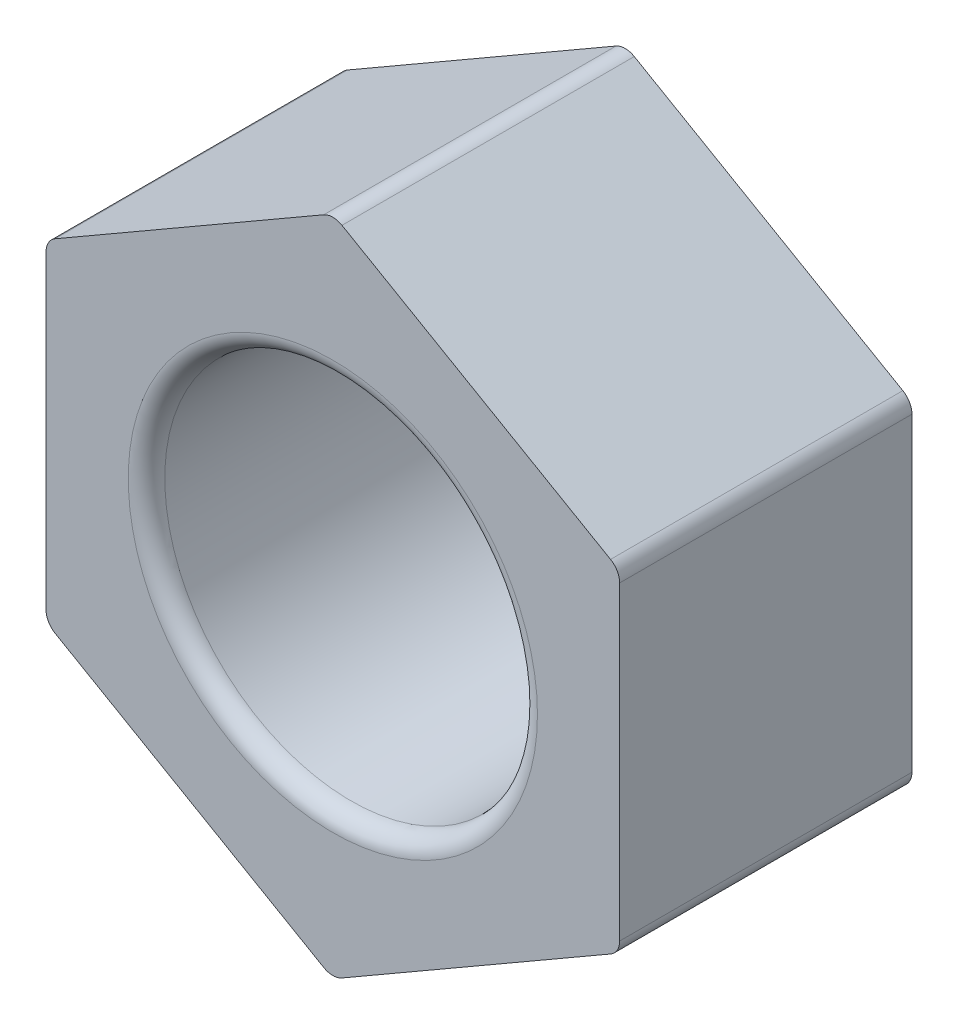
ISO-10303-21;
HEADER;
FILE_DESCRIPTION(('STEP AP214'),'2;1');
FILE_NAME('part.step','',(''),(''),'','','');
FILE_SCHEMA(('AUTOMOTIVE_DESIGN { 1 0 10303 214 1 1 1 1 }'));
ENDSEC;
DATA;
#1=APPLICATION_CONTEXT('core data for automotive mechanical design processes');
#2=APPLICATION_PROTOCOL_DEFINITION('international standard','automotive_design',2000,#1);
#3=PRODUCT_CONTEXT('',#1,'mechanical');
#4=PRODUCT('Part','Part','',(#3));
#5=PRODUCT_RELATED_PRODUCT_CATEGORY('part','',(#4));
#6=PRODUCT_DEFINITION_FORMATION('','',#4);
#7=PRODUCT_DEFINITION_CONTEXT('part definition',#1,'design');
#8=PRODUCT_DEFINITION('design','',#6,#7);
#9=PRODUCT_DEFINITION_SHAPE('','',#8);
#10=(LENGTH_UNIT() NAMED_UNIT(*) SI_UNIT(.MILLI.,.METRE.));
#11=(NAMED_UNIT(*) PLANE_ANGLE_UNIT() SI_UNIT($,.RADIAN.));
#12=(NAMED_UNIT(*) SI_UNIT($,.STERADIAN.) SOLID_ANGLE_UNIT());
#13=UNCERTAINTY_MEASURE_WITH_UNIT(LENGTH_MEASURE(1.E-05),#10,'distance_accuracy_value','');
#14=(GEOMETRIC_REPRESENTATION_CONTEXT(3) GLOBAL_UNCERTAINTY_ASSIGNED_CONTEXT((#13)) GLOBAL_UNIT_ASSIGNED_CONTEXT((#10,
#11,#12)) REPRESENTATION_CONTEXT('',''));
#15=CARTESIAN_POINT('',(0.,0.,0.));
#16=DIRECTION('',(0.,0.,1.));
#17=DIRECTION('',(1.,0.,0.));
#18=AXIS2_PLACEMENT_3D('',#15,#16,#17);
#19=CARTESIAN_POINT('',(3.925,2.26609980656928,4.));
#20=DIRECTION('',(-0.5,-0.866025403784439,0.));
#21=DIRECTION('',(0.866025403784439,-0.5,0.));
#22=AXIS2_PLACEMENT_3D('',#19,#20,#21);
#23=PLANE('',#22);
#24=DIRECTION('',(-0.866025403784439,0.5,0.));
#25=VECTOR('',#24,1.);
#26=CARTESIAN_POINT('',(3.925,2.26609980656928,4.));
#27=LINE('',#26,#25);
#28=CARTESIAN_POINT('',(3.8,2.33826859021799,4.));
#29=VERTEX_POINT('',#28);
#30=CARTESIAN_POINT('',(0.124999999999998,4.46003082948986,4.));
#31=VERTEX_POINT('',#30);
#32=EDGE_CURVE('E135',#29,#31,#27,.T.);
#33=ORIENTED_EDGE('',*,*,#32,.F.);
#34=DIRECTION('',(0.,0.,-1.));
#35=VECTOR('',#34,1.);
#36=CARTESIAN_POINT('',(3.8,2.33826859021799,4.));
#37=LINE('',#36,#35);
#38=CARTESIAN_POINT('',(3.8,2.33826859021799,0.));
#39=VERTEX_POINT('',#38);
#40=EDGE_CURVE('E11',#29,#39,#37,.T.);
#41=ORIENTED_EDGE('',*,*,#40,.T.);
#42=DIRECTION('',(-0.866025403784439,0.5,0.));
#43=VECTOR('',#42,1.);
#44=CARTESIAN_POINT('',(3.925,2.26609980656928,0.));
#45=LINE('',#44,#43);
#46=CARTESIAN_POINT('',(0.124999999999998,4.46003082948986,0.));
#47=VERTEX_POINT('',#46);
#48=EDGE_CURVE('E295',#39,#47,#45,.T.);
#49=ORIENTED_EDGE('',*,*,#48,.T.);
#50=DIRECTION('',(0.,0.,-1.));
#51=VECTOR('',#50,1.);
#52=CARTESIAN_POINT('',(0.124999999999998,4.46003082948986,4.));
#53=LINE('',#52,#51);
#54=EDGE_CURVE('E47',#47,#31,#53,.F.);
#55=ORIENTED_EDGE('',*,*,#54,.T.);
#56=EDGE_LOOP('',(#33,#41,#49,#55));
#57=FACE_BOUND('',#56,.T.);
#58=ADVANCED_FACE('F39',(#57),#23,.F.);
#59=CARTESIAN_POINT('',(0.,4.53219961313857,4.));
#60=DIRECTION('',(0.5,-0.866025403784439,0.));
#61=DIRECTION('',(0.866025403784439,0.5,0.));
#62=AXIS2_PLACEMENT_3D('',#59,#60,#61);
#63=PLANE('',#62);
#64=DIRECTION('',(-0.866025403784439,-0.5,0.));
#65=VECTOR('',#64,1.);
#66=CARTESIAN_POINT('',(0.,4.53219961313857,0.));
#67=LINE('',#66,#65);
#68=CARTESIAN_POINT('',(-0.125000000000002,4.46003082948986,0.));
#69=VERTEX_POINT('',#68);
#70=CARTESIAN_POINT('',(-3.8,2.33826859021799,0.));
#71=VERTEX_POINT('',#70);
#72=EDGE_CURVE('E297',#69,#71,#67,.T.);
#73=ORIENTED_EDGE('',*,*,#72,.T.);
#74=DIRECTION('',(0.,0.,-1.));
#75=VECTOR('',#74,1.);
#76=CARTESIAN_POINT('',(-3.8,2.33826859021799,4.));
#77=LINE('',#76,#75);
#78=CARTESIAN_POINT('',(-3.8,2.33826859021799,4.));
#79=VERTEX_POINT('',#78);
#80=EDGE_CURVE('E178',#71,#79,#77,.F.);
#81=ORIENTED_EDGE('',*,*,#80,.T.);
#82=DIRECTION('',(-0.866025403784439,-0.5,0.));
#83=VECTOR('',#82,1.);
#84=CARTESIAN_POINT('',(0.,4.53219961313857,4.));
#85=LINE('',#84,#83);
#86=CARTESIAN_POINT('',(-0.125000000000002,4.46003082948986,4.));
#87=VERTEX_POINT('',#86);
#88=EDGE_CURVE('E148',#87,#79,#85,.T.);
#89=ORIENTED_EDGE('',*,*,#88,.F.);
#90=DIRECTION('',(0.,0.,-1.));
#91=VECTOR('',#90,1.);
#92=CARTESIAN_POINT('',(-0.125000000000002,4.46003082948986,4.));
#93=LINE('',#92,#91);
#94=EDGE_CURVE('E176',#87,#69,#93,.T.);
#95=ORIENTED_EDGE('',*,*,#94,.T.);
#96=EDGE_LOOP('',(#73,#81,#89,#95));
#97=FACE_BOUND('',#96,.T.);
#98=ADVANCED_FACE('F251',(#97),#63,.F.);
#99=CARTESIAN_POINT('',(-3.925,2.26609980656929,4.));
#100=DIRECTION('',(1.,0.,0.));
#101=DIRECTION('',(0.,1.,0.));
#102=AXIS2_PLACEMENT_3D('',#99,#100,#101);
#103=PLANE('',#102);
#104=DIRECTION('',(0.,-1.,0.));
#105=VECTOR('',#104,1.);
#106=CARTESIAN_POINT('',(-3.925,2.26609980656929,4.));
#107=LINE('',#106,#105);
#108=CARTESIAN_POINT('',(-3.925,2.12176223927188,4.));
#109=VERTEX_POINT('',#108);
#110=CARTESIAN_POINT('',(-3.925,-2.12176223927188,4.));
#111=VERTEX_POINT('',#110);
#112=EDGE_CURVE('E283',#109,#111,#107,.T.);
#113=ORIENTED_EDGE('',*,*,#112,.F.);
#114=DIRECTION('',(0.,0.,-1.));
#115=VECTOR('',#114,1.);
#116=CARTESIAN_POINT('',(-3.925,2.12176223927188,4.));
#117=LINE('',#116,#115);
#118=CARTESIAN_POINT('',(-3.925,2.12176223927188,0.));
#119=VERTEX_POINT('',#118);
#120=EDGE_CURVE('E173',#109,#119,#117,.T.);
#121=ORIENTED_EDGE('',*,*,#120,.T.);
#122=DIRECTION('',(0.,-1.,0.));
#123=VECTOR('',#122,1.);
#124=CARTESIAN_POINT('',(-3.925,2.26609980656929,0.));
#125=LINE('',#124,#123);
#126=CARTESIAN_POINT('',(-3.925,-2.12176223927188,0.));
#127=VERTEX_POINT('',#126);
#128=EDGE_CURVE('E299',#119,#127,#125,.T.);
#129=ORIENTED_EDGE('',*,*,#128,.T.);
#130=DIRECTION('',(0.,0.,-1.));
#131=VECTOR('',#130,1.);
#132=CARTESIAN_POINT('',(-3.925,-2.12176223927188,4.));
#133=LINE('',#132,#131);
#134=EDGE_CURVE('E171',#127,#111,#133,.F.);
#135=ORIENTED_EDGE('',*,*,#134,.T.);
#136=EDGE_LOOP('',(#113,#121,#129,#135));
#137=FACE_BOUND('',#136,.T.);
#138=ADVANCED_FACE('F256',(#137),#103,.F.);
#139=CARTESIAN_POINT('',(-3.925,-2.26609980656928,4.));
#140=DIRECTION('',(0.5,0.866025403784439,0.));
#141=DIRECTION('',(-0.866025403784439,0.5,0.));
#142=AXIS2_PLACEMENT_3D('',#139,#140,#141);
#143=PLANE('',#142);
#144=DIRECTION('',(0.866025403784439,-0.5,0.));
#145=VECTOR('',#144,1.);
#146=CARTESIAN_POINT('',(-3.925,-2.26609980656928,4.));
#147=LINE('',#146,#145);
#148=CARTESIAN_POINT('',(-3.8,-2.33826859021798,4.));
#149=VERTEX_POINT('',#148);
#150=CARTESIAN_POINT('',(-0.125000000000001,-4.46003082948986,4.));
#151=VERTEX_POINT('',#150);
#152=EDGE_CURVE('E286',#149,#151,#147,.T.);
#153=ORIENTED_EDGE('',*,*,#152,.F.);
#154=DIRECTION('',(0.,0.,-1.));
#155=VECTOR('',#154,1.);
#156=CARTESIAN_POINT('',(-3.8,-2.33826859021798,4.));
#157=LINE('',#156,#155);
#158=CARTESIAN_POINT('',(-3.8,-2.33826859021798,0.));
#159=VERTEX_POINT('',#158);
#160=EDGE_CURVE('E182',#149,#159,#157,.T.);
#161=ORIENTED_EDGE('',*,*,#160,.T.);
#162=DIRECTION('',(0.866025403784439,-0.5,0.));
#163=VECTOR('',#162,1.);
#164=CARTESIAN_POINT('',(-3.925,-2.26609980656928,0.));
#165=LINE('',#164,#163);
#166=CARTESIAN_POINT('',(-0.125000000000001,-4.46003082948986,0.));
#167=VERTEX_POINT('',#166);
#168=EDGE_CURVE('E203',#159,#167,#165,.T.);
#169=ORIENTED_EDGE('',*,*,#168,.T.);
#170=DIRECTION('',(0.,0.,-1.));
#171=VECTOR('',#170,1.);
#172=CARTESIAN_POINT('',(-0.125000000000001,-4.46003082948986,4.));
#173=LINE('',#172,#171);
#174=EDGE_CURVE('E180',#167,#151,#173,.F.);
#175=ORIENTED_EDGE('',*,*,#174,.T.);
#176=EDGE_LOOP('',(#153,#161,#169,#175));
#177=FACE_BOUND('',#176,.T.);
#178=ADVANCED_FACE('F306',(#177),#143,.F.);
#179=CARTESIAN_POINT('',(0.,-4.53219961313856,4.));
#180=DIRECTION('',(-0.5,0.866025403784439,0.));
#181=DIRECTION('',(-0.866025403784439,-0.5,0.));
#182=AXIS2_PLACEMENT_3D('',#179,#180,#181);
#183=PLANE('',#182);
#184=DIRECTION('',(0.866025403784439,0.5,0.));
#185=VECTOR('',#184,1.);
#186=CARTESIAN_POINT('',(0.,-4.53219961313856,4.));
#187=LINE('',#186,#185);
#188=CARTESIAN_POINT('',(0.124999999999999,-4.46003082948986,4.));
#189=VERTEX_POINT('',#188);
#190=CARTESIAN_POINT('',(3.8,-2.33826859021799,4.));
#191=VERTEX_POINT('',#190);
#192=EDGE_CURVE('E291',#189,#191,#187,.T.);
#193=ORIENTED_EDGE('',*,*,#192,.F.);
#194=DIRECTION('',(0.,0.,-1.));
#195=VECTOR('',#194,1.);
#196=CARTESIAN_POINT('',(0.124999999999999,-4.46003082948986,4.));
#197=LINE('',#196,#195);
#198=CARTESIAN_POINT('',(0.124999999999999,-4.46003082948986,0.));
#199=VERTEX_POINT('',#198);
#200=EDGE_CURVE('E187',#189,#199,#197,.T.);
#201=ORIENTED_EDGE('',*,*,#200,.T.);
#202=DIRECTION('',(0.866025403784439,0.5,0.));
#203=VECTOR('',#202,1.);
#204=CARTESIAN_POINT('',(0.,-4.53219961313856,0.));
#205=LINE('',#204,#203);
#206=CARTESIAN_POINT('',(3.8,-2.33826859021799,0.));
#207=VERTEX_POINT('',#206);
#208=EDGE_CURVE('E201',#199,#207,#205,.T.);
#209=ORIENTED_EDGE('',*,*,#208,.T.);
#210=DIRECTION('',(0.,0.,-1.));
#211=VECTOR('',#210,1.);
#212=CARTESIAN_POINT('',(3.8,-2.33826859021799,4.));
#213=LINE('',#212,#211);
#214=EDGE_CURVE('E185',#207,#191,#213,.F.);
#215=ORIENTED_EDGE('',*,*,#214,.T.);
#216=EDGE_LOOP('',(#193,#201,#209,#215));
#217=FACE_BOUND('',#216,.T.);
#218=ADVANCED_FACE('F312',(#217),#183,.F.);
#219=CARTESIAN_POINT('',(3.925,-2.26609980656928,4.));
#220=DIRECTION('',(-1.,0.,0.));
#221=DIRECTION('',(0.,0.,1.));
#222=AXIS2_PLACEMENT_3D('',#219,#220,#221);
#223=PLANE('',#222);
#224=DIRECTION('',(0.,1.,0.));
#225=VECTOR('',#224,1.);
#226=CARTESIAN_POINT('',(3.925,-2.26609980656928,4.));
#227=LINE('',#226,#225);
#228=CARTESIAN_POINT('',(3.925,-2.12176223927188,4.));
#229=VERTEX_POINT('',#228);
#230=CARTESIAN_POINT('',(3.925,2.12176223927188,4.));
#231=VERTEX_POINT('',#230);
#232=EDGE_CURVE('E138',#229,#231,#227,.T.);
#233=ORIENTED_EDGE('',*,*,#232,.F.);
#234=DIRECTION('',(0.,0.,-1.));
#235=VECTOR('',#234,1.);
#236=CARTESIAN_POINT('',(3.925,-2.12176223927188,4.));
#237=LINE('',#236,#235);
#238=CARTESIAN_POINT('',(3.925,-2.12176223927188,0.));
#239=VERTEX_POINT('',#238);
#240=EDGE_CURVE('E191',#229,#239,#237,.T.);
#241=ORIENTED_EDGE('',*,*,#240,.T.);
#242=DIRECTION('',(0.,1.,0.));
#243=VECTOR('',#242,1.);
#244=CARTESIAN_POINT('',(3.925,-2.26609980656928,0.));
#245=LINE('',#244,#243);
#246=CARTESIAN_POINT('',(3.925,2.12176223927188,0.));
#247=VERTEX_POINT('',#246);
#248=EDGE_CURVE('E149',#239,#247,#245,.T.);
#249=ORIENTED_EDGE('',*,*,#248,.T.);
#250=DIRECTION('',(0.,0.,-1.));
#251=VECTOR('',#250,1.);
#252=CARTESIAN_POINT('',(3.925,2.12176223927188,4.));
#253=LINE('',#252,#251);
#254=EDGE_CURVE('E153',#247,#231,#253,.F.);
#255=ORIENTED_EDGE('',*,*,#254,.T.);
#256=EDGE_LOOP('',(#233,#241,#249,#255));
#257=FACE_BOUND('',#256,.T.);
#258=ADVANCED_FACE('F195',(#257),#223,.F.);
#259=CARTESIAN_POINT('',(0.,0.,4.));
#260=DIRECTION('',(0.,0.,1.));
#261=DIRECTION('',(1.,0.,0.));
#262=AXIS2_PLACEMENT_3D('',#259,#260,#261);
#263=PLANE('',#262);
#264=CARTESIAN_POINT('',(0.,0.,4.));
#265=DIRECTION('',(0.,0.,1.));
#266=DIRECTION('',(1.,0.,0.));
#267=AXIS2_PLACEMENT_3D('',#264,#265,#266);
#268=CIRCLE('',#267,2.8);
#269=CARTESIAN_POINT('',(2.8,0.,4.));
#270=VERTEX_POINT('',#269);
#271=EDGE_CURVE('E160',#270,#270,#268,.F.);
#272=ORIENTED_EDGE('',*,*,#271,.T.);
#273=EDGE_LOOP('',(#272));
#274=FACE_BOUND('',#273,.T.);
#275=ORIENTED_EDGE('',*,*,#88,.T.);
#276=CARTESIAN_POINT('',(-3.675,2.12176223927188,4.));
#277=DIRECTION('',(0.,0.,1.));
#278=DIRECTION('',(1.,0.,0.));
#279=AXIS2_PLACEMENT_3D('',#276,#277,#278);
#280=CIRCLE('',#279,0.25);
#281=EDGE_CURVE('E219',#79,#109,#280,.T.);
#282=ORIENTED_EDGE('',*,*,#281,.T.);
#283=ORIENTED_EDGE('',*,*,#112,.T.);
#284=CARTESIAN_POINT('',(-3.675,-2.12176223927187,4.));
#285=DIRECTION('',(0.,0.,1.));
#286=DIRECTION('',(1.,0.,0.));
#287=AXIS2_PLACEMENT_3D('',#284,#285,#286);
#288=CIRCLE('',#287,0.25);
#289=EDGE_CURVE('E217',#111,#149,#288,.T.);
#290=ORIENTED_EDGE('',*,*,#289,.T.);
#291=ORIENTED_EDGE('',*,*,#152,.T.);
#292=CARTESIAN_POINT('',(0.,-4.24352447854375,4.));
#293=DIRECTION('',(0.,0.,1.));
#294=DIRECTION('',(1.,0.,0.));
#295=AXIS2_PLACEMENT_3D('',#292,#293,#294);
#296=CIRCLE('',#295,0.25);
#297=EDGE_CURVE('E215',#151,#189,#296,.T.);
#298=ORIENTED_EDGE('',*,*,#297,.T.);
#299=ORIENTED_EDGE('',*,*,#192,.T.);
#300=CARTESIAN_POINT('',(3.675,-2.12176223927188,4.));
#301=DIRECTION('',(0.,0.,1.));
#302=DIRECTION('',(1.,0.,0.));
#303=AXIS2_PLACEMENT_3D('',#300,#301,#302);
#304=CIRCLE('',#303,0.25);
#305=EDGE_CURVE('E142',#191,#229,#304,.T.);
#306=ORIENTED_EDGE('',*,*,#305,.T.);
#307=ORIENTED_EDGE('',*,*,#232,.T.);
#308=CARTESIAN_POINT('',(3.675,2.12176223927188,4.));
#309=DIRECTION('',(0.,0.,1.));
#310=DIRECTION('',(1.,0.,0.));
#311=AXIS2_PLACEMENT_3D('',#308,#309,#310);
#312=CIRCLE('',#311,0.25);
#313=EDGE_CURVE('E131',#231,#29,#312,.T.);
#314=ORIENTED_EDGE('',*,*,#313,.T.);
#315=ORIENTED_EDGE('',*,*,#32,.T.);
#316=CARTESIAN_POINT('',(0.,4.24352447854375,4.));
#317=DIRECTION('',(0.,0.,1.));
#318=DIRECTION('',(1.,0.,0.));
#319=AXIS2_PLACEMENT_3D('',#316,#317,#318);
#320=CIRCLE('',#319,0.25);
#321=EDGE_CURVE('E143',#31,#87,#320,.T.);
#322=ORIENTED_EDGE('',*,*,#321,.T.);
#323=EDGE_LOOP('',(#275,#282,#283,#290,#291,#298,#299,#306,#307,#314,#315,#322));
#324=FACE_BOUND('',#323,.T.);
#325=ADVANCED_FACE('F134',(#274,#324),#263,.T.);
#326=CARTESIAN_POINT('',(0.,0.,0.));
#327=DIRECTION('',(0.,0.,1.));
#328=DIRECTION('',(1.,0.,0.));
#329=AXIS2_PLACEMENT_3D('',#326,#327,#328);
#330=PLANE('',#329);
#331=CARTESIAN_POINT('',(0.,0.,0.));
#332=DIRECTION('',(0.,0.,1.));
#333=DIRECTION('',(1.,0.,0.));
#334=AXIS2_PLACEMENT_3D('',#331,#332,#333);
#335=CIRCLE('',#334,2.8);
#336=CARTESIAN_POINT('',(2.8,0.,0.));
#337=VERTEX_POINT('',#336);
#338=EDGE_CURVE('E168',#337,#337,#335,.T.);
#339=ORIENTED_EDGE('',*,*,#338,.T.);
#340=EDGE_LOOP('',(#339));
#341=FACE_BOUND('',#340,.T.);
#342=ORIENTED_EDGE('',*,*,#128,.F.);
#343=CARTESIAN_POINT('',(-3.675,2.12176223927188,0.));
#344=DIRECTION('',(0.,0.,1.));
#345=DIRECTION('',(1.,0.,0.));
#346=AXIS2_PLACEMENT_3D('',#343,#344,#345);
#347=CIRCLE('',#346,0.25);
#348=EDGE_CURVE('E54',#119,#71,#347,.F.);
#349=ORIENTED_EDGE('',*,*,#348,.T.);
#350=ORIENTED_EDGE('',*,*,#72,.F.);
#351=CARTESIAN_POINT('',(0.,4.24352447854375,0.));
#352=DIRECTION('',(0.,0.,1.));
#353=DIRECTION('',(1.,0.,0.));
#354=AXIS2_PLACEMENT_3D('',#351,#352,#353);
#355=CIRCLE('',#354,0.25);
#356=EDGE_CURVE('E62',#69,#47,#355,.F.);
#357=ORIENTED_EDGE('',*,*,#356,.T.);
#358=ORIENTED_EDGE('',*,*,#48,.F.);
#359=CARTESIAN_POINT('',(3.675,2.12176223927188,0.));
#360=DIRECTION('',(0.,0.,1.));
#361=DIRECTION('',(1.,0.,0.));
#362=AXIS2_PLACEMENT_3D('',#359,#360,#361);
#363=CIRCLE('',#362,0.25);
#364=EDGE_CURVE('E152',#39,#247,#363,.F.);
#365=ORIENTED_EDGE('',*,*,#364,.T.);
#366=ORIENTED_EDGE('',*,*,#248,.F.);
#367=CARTESIAN_POINT('',(3.675,-2.12176223927188,0.));
#368=DIRECTION('',(0.,0.,1.));
#369=DIRECTION('',(1.,0.,0.));
#370=AXIS2_PLACEMENT_3D('',#367,#368,#369);
#371=CIRCLE('',#370,0.25);
#372=EDGE_CURVE('E156',#239,#207,#371,.F.);
#373=ORIENTED_EDGE('',*,*,#372,.T.);
#374=ORIENTED_EDGE('',*,*,#208,.F.);
#375=CARTESIAN_POINT('',(0.,-4.24352447854375,0.));
#376=DIRECTION('',(0.,0.,1.));
#377=DIRECTION('',(1.,0.,0.));
#378=AXIS2_PLACEMENT_3D('',#375,#376,#377);
#379=CIRCLE('',#378,0.25);
#380=EDGE_CURVE('E158',#199,#167,#379,.F.);
#381=ORIENTED_EDGE('',*,*,#380,.T.);
#382=ORIENTED_EDGE('',*,*,#168,.F.);
#383=CARTESIAN_POINT('',(-3.675,-2.12176223927187,0.));
#384=DIRECTION('',(0.,0.,1.));
#385=DIRECTION('',(1.,0.,0.));
#386=AXIS2_PLACEMENT_3D('',#383,#384,#385);
#387=CIRCLE('',#386,0.25);
#388=EDGE_CURVE('E165',#159,#127,#387,.F.);
#389=ORIENTED_EDGE('',*,*,#388,.T.);
#390=EDGE_LOOP('',(#342,#349,#350,#357,#358,#365,#366,#373,#374,#381,#382,#389));
#391=FACE_BOUND('',#390,.T.);
#392=ADVANCED_FACE('F198',(#341,#391),#330,.F.);
#393=CARTESIAN_POINT('',(0.,0.,0.));
#394=DIRECTION('',(0.,0.,1.));
#395=DIRECTION('',(1.,0.,0.));
#396=AXIS2_PLACEMENT_3D('',#393,#394,#395);
#397=CYLINDRICAL_SURFACE('',#396,2.55);
#398=CARTESIAN_POINT('',(0.,0.,3.75));
#399=DIRECTION('',(0.,0.,1.));
#400=DIRECTION('',(1.,0.,0.));
#401=AXIS2_PLACEMENT_3D('',#398,#399,#400);
#402=CIRCLE('',#401,2.55);
#403=CARTESIAN_POINT('',(2.55,0.,3.75));
#404=VERTEX_POINT('',#403);
#405=EDGE_CURVE('E210',#404,#404,#402,.T.);
#406=ORIENTED_EDGE('',*,*,#405,.T.);
#407=EDGE_LOOP('',(#406));
#408=FACE_BOUND('',#407,.T.);
#409=CARTESIAN_POINT('',(0.,0.,0.25));
#410=DIRECTION('',(0.,0.,1.));
#411=DIRECTION('',(1.,0.,0.));
#412=AXIS2_PLACEMENT_3D('',#409,#410,#411);
#413=CIRCLE('',#412,2.55);
#414=CARTESIAN_POINT('',(2.55,0.,0.25));
#415=VERTEX_POINT('',#414);
#416=EDGE_CURVE('E207',#415,#415,#413,.F.);
#417=ORIENTED_EDGE('',*,*,#416,.T.);
#418=EDGE_LOOP('',(#417));
#419=FACE_BOUND('',#418,.T.);
#420=ADVANCED_FACE('F228',(#408,#419),#397,.F.);
#421=CARTESIAN_POINT('',(0.,0.,3.75));
#422=DIRECTION('',(0.,0.,1.));
#423=DIRECTION('',(1.,0.,0.));
#424=AXIS2_PLACEMENT_3D('',#421,#422,#423);
#425=TOROIDAL_SURFACE('',#424,2.8,0.25);
#426=ORIENTED_EDGE('',*,*,#271,.F.);
#427=EDGE_LOOP('',(#426));
#428=FACE_BOUND('',#427,.T.);
#429=ORIENTED_EDGE('',*,*,#405,.F.);
#430=EDGE_LOOP('',(#429));
#431=FACE_BOUND('',#430,.T.);
#432=ADVANCED_FACE('F224',(#428,#431),#425,.T.);
#433=CARTESIAN_POINT('',(0.,0.,0.25));
#434=DIRECTION('',(0.,0.,1.));
#435=DIRECTION('',(1.,0.,0.));
#436=AXIS2_PLACEMENT_3D('',#433,#434,#435);
#437=TOROIDAL_SURFACE('',#436,2.8,0.25);
#438=ORIENTED_EDGE('',*,*,#416,.F.);
#439=EDGE_LOOP('',(#438));
#440=FACE_BOUND('',#439,.T.);
#441=ORIENTED_EDGE('',*,*,#338,.F.);
#442=EDGE_LOOP('',(#441));
#443=FACE_BOUND('',#442,.T.);
#444=ADVANCED_FACE('F227',(#440,#443),#437,.T.);
#445=CARTESIAN_POINT('',(-3.675,2.12176223927188,4.));
#446=DIRECTION('',(0.,0.,-1.));
#447=DIRECTION('',(-1.,0.,0.));
#448=AXIS2_PLACEMENT_3D('',#445,#446,#447);
#449=CYLINDRICAL_SURFACE('',#448,0.25);
#450=ORIENTED_EDGE('',*,*,#281,.F.);
#451=ORIENTED_EDGE('',*,*,#80,.F.);
#452=ORIENTED_EDGE('',*,*,#348,.F.);
#453=ORIENTED_EDGE('',*,*,#120,.F.);
#454=EDGE_LOOP('',(#450,#451,#452,#453));
#455=FACE_BOUND('',#454,.T.);
#456=ADVANCED_FACE('F239',(#455),#449,.T.);
#457=CARTESIAN_POINT('',(-3.675,-2.12176223927187,4.));
#458=DIRECTION('',(0.,0.,-1.));
#459=DIRECTION('',(-1.,0.,0.));
#460=AXIS2_PLACEMENT_3D('',#457,#458,#459);
#461=CYLINDRICAL_SURFACE('',#460,0.25);
#462=ORIENTED_EDGE('',*,*,#289,.F.);
#463=ORIENTED_EDGE('',*,*,#134,.F.);
#464=ORIENTED_EDGE('',*,*,#388,.F.);
#465=ORIENTED_EDGE('',*,*,#160,.F.);
#466=EDGE_LOOP('',(#462,#463,#464,#465));
#467=FACE_BOUND('',#466,.T.);
#468=ADVANCED_FACE('F263',(#467),#461,.T.);
#469=CARTESIAN_POINT('',(0.,-4.24352447854375,4.));
#470=DIRECTION('',(0.,0.,-1.));
#471=DIRECTION('',(-1.,0.,0.));
#472=AXIS2_PLACEMENT_3D('',#469,#470,#471);
#473=CYLINDRICAL_SURFACE('',#472,0.25);
#474=ORIENTED_EDGE('',*,*,#297,.F.);
#475=ORIENTED_EDGE('',*,*,#174,.F.);
#476=ORIENTED_EDGE('',*,*,#380,.F.);
#477=ORIENTED_EDGE('',*,*,#200,.F.);
#478=EDGE_LOOP('',(#474,#475,#476,#477));
#479=FACE_BOUND('',#478,.T.);
#480=ADVANCED_FACE('F267',(#479),#473,.T.);
#481=CARTESIAN_POINT('',(3.675,-2.12176223927188,4.));
#482=DIRECTION('',(0.,0.,-1.));
#483=DIRECTION('',(-1.,0.,0.));
#484=AXIS2_PLACEMENT_3D('',#481,#482,#483);
#485=CYLINDRICAL_SURFACE('',#484,0.25);
#486=ORIENTED_EDGE('',*,*,#305,.F.);
#487=ORIENTED_EDGE('',*,*,#214,.F.);
#488=ORIENTED_EDGE('',*,*,#372,.F.);
#489=ORIENTED_EDGE('',*,*,#240,.F.);
#490=EDGE_LOOP('',(#486,#487,#488,#489));
#491=FACE_BOUND('',#490,.T.);
#492=ADVANCED_FACE('F271',(#491),#485,.T.);
#493=CARTESIAN_POINT('',(3.675,2.12176223927188,4.));
#494=DIRECTION('',(0.,0.,-1.));
#495=DIRECTION('',(-1.,0.,0.));
#496=AXIS2_PLACEMENT_3D('',#493,#494,#495);
#497=CYLINDRICAL_SURFACE('',#496,0.25);
#498=ORIENTED_EDGE('',*,*,#313,.F.);
#499=ORIENTED_EDGE('',*,*,#254,.F.);
#500=ORIENTED_EDGE('',*,*,#364,.F.);
#501=ORIENTED_EDGE('',*,*,#40,.F.);
#502=EDGE_LOOP('',(#498,#499,#500,#501));
#503=FACE_BOUND('',#502,.T.);
#504=ADVANCED_FACE('F151',(#503),#497,.T.);
#505=CARTESIAN_POINT('',(0.,4.24352447854375,4.));
#506=DIRECTION('',(0.,0.,-1.));
#507=DIRECTION('',(-1.,0.,0.));
#508=AXIS2_PLACEMENT_3D('',#505,#506,#507);
#509=CYLINDRICAL_SURFACE('',#508,0.25);
#510=ORIENTED_EDGE('',*,*,#321,.F.);
#511=ORIENTED_EDGE('',*,*,#54,.F.);
#512=ORIENTED_EDGE('',*,*,#356,.F.);
#513=ORIENTED_EDGE('',*,*,#94,.F.);
#514=EDGE_LOOP('',(#510,#511,#512,#513));
#515=FACE_BOUND('',#514,.T.);
#516=ADVANCED_FACE('F41',(#515),#509,.T.);
#517=CLOSED_SHELL('',(#58,#98,#138,#178,#218,#258,#325,#392,#420,#432,#444,#456,#468,#480,#492,
#504,#516));
#518=MANIFOLD_SOLID_BREP('B2',#517);
#519=ADVANCED_BREP_SHAPE_REPRESENTATION('',(#18,#518),#14);
#520=SHAPE_DEFINITION_REPRESENTATION(#9,#519);
ENDSEC;
END-ISO-10303-21;
